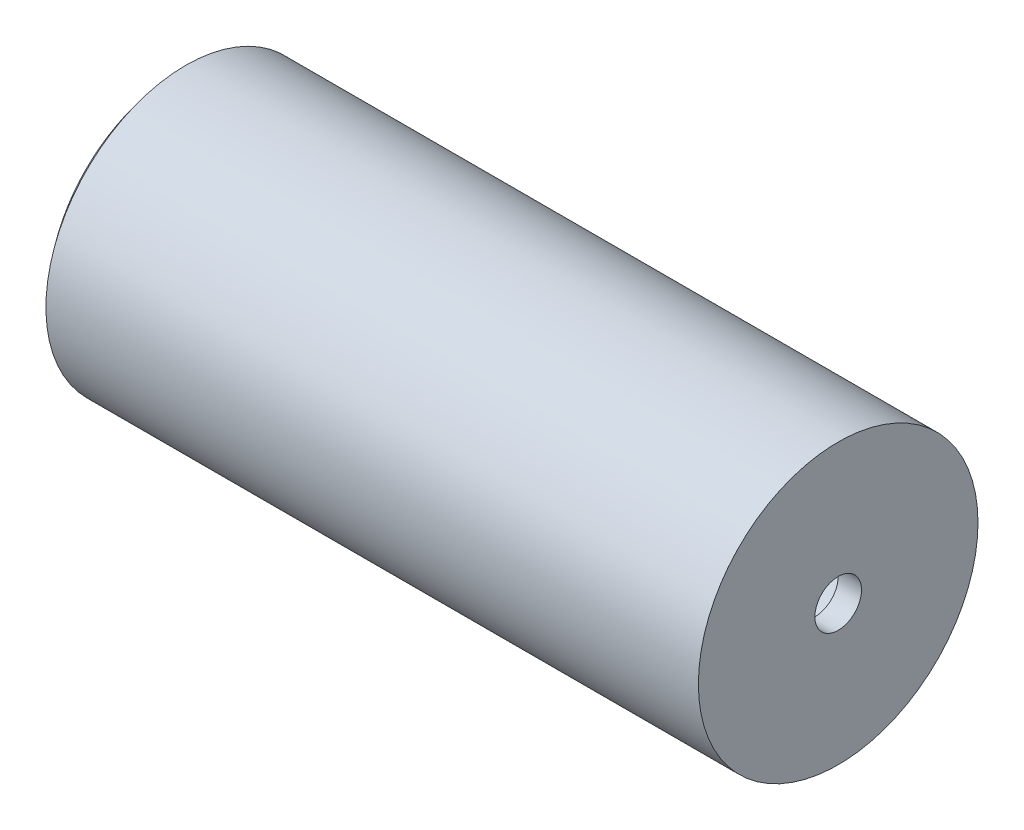
ISO-10303-21;
HEADER;
FILE_DESCRIPTION(('STEP AP214'),'2;1');
FILE_NAME('part.step','',(''),(''),'','','');
FILE_SCHEMA(('AUTOMOTIVE_DESIGN { 1 0 10303 214 1 1 1 1 }'));
ENDSEC;
DATA;
#1=APPLICATION_CONTEXT('core data for automotive mechanical design processes');
#2=APPLICATION_PROTOCOL_DEFINITION('international standard','automotive_design',2000,#1);
#3=PRODUCT_CONTEXT('',#1,'mechanical');
#4=PRODUCT('Part','Part','',(#3));
#5=PRODUCT_RELATED_PRODUCT_CATEGORY('part','',(#4));
#6=PRODUCT_DEFINITION_FORMATION('','',#4);
#7=PRODUCT_DEFINITION_CONTEXT('part definition',#1,'design');
#8=PRODUCT_DEFINITION('design','',#6,#7);
#9=PRODUCT_DEFINITION_SHAPE('','',#8);
#10=(LENGTH_UNIT() NAMED_UNIT(*) SI_UNIT(.MILLI.,.METRE.));
#11=(NAMED_UNIT(*) PLANE_ANGLE_UNIT() SI_UNIT($,.RADIAN.));
#12=(NAMED_UNIT(*) SI_UNIT($,.STERADIAN.) SOLID_ANGLE_UNIT());
#13=UNCERTAINTY_MEASURE_WITH_UNIT(LENGTH_MEASURE(1.E-05),#10,'distance_accuracy_value','');
#14=(GEOMETRIC_REPRESENTATION_CONTEXT(3) GLOBAL_UNCERTAINTY_ASSIGNED_CONTEXT((#13)) GLOBAL_UNIT_ASSIGNED_CONTEXT((#10,
#11,#12)) REPRESENTATION_CONTEXT('',''));
#15=CARTESIAN_POINT('',(0.,0.,0.));
#16=DIRECTION('',(0.,0.,1.));
#17=DIRECTION('',(1.,0.,0.));
#18=AXIS2_PLACEMENT_3D('',#15,#16,#17);
#19=CARTESIAN_POINT('',(0.,0.,0.));
#20=DIRECTION('',(1.,0.,0.));
#21=DIRECTION('',(0.,0.,-1.));
#22=AXIS2_PLACEMENT_3D('',#19,#20,#21);
#23=CYLINDRICAL_SURFACE('',#22,5.00000000000004);
#24=CARTESIAN_POINT('',(169.943031877068,0.,0.));
#25=DIRECTION('',(1.,0.,0.));
#26=DIRECTION('',(0.,0.,-1.));
#27=AXIS2_PLACEMENT_3D('',#24,#25,#26);
#28=CIRCLE('',#27,5.00000000000004);
#29=CARTESIAN_POINT('',(169.943031877068,0.,-5.00000000000004));
#30=VERTEX_POINT('',#29);
#31=EDGE_CURVE('E10',#30,#30,#28,.T.);
#32=ORIENTED_EDGE('',*,*,#31,.T.);
#33=EDGE_LOOP('',(#32));
#34=FACE_BOUND('',#33,.T.);
#35=CARTESIAN_POINT('',(164.943031877068,0.,0.));
#36=DIRECTION('',(1.,0.,0.));
#37=DIRECTION('',(0.,0.,-1.));
#38=AXIS2_PLACEMENT_3D('',#35,#36,#37);
#39=CIRCLE('',#38,5.00000000000004);
#40=CARTESIAN_POINT('',(164.943031877068,0.,-5.00000000000004));
#41=VERTEX_POINT('',#40);
#42=EDGE_CURVE('E57',#41,#41,#39,.T.);
#43=ORIENTED_EDGE('',*,*,#42,.F.);
#44=EDGE_LOOP('',(#43));
#45=FACE_BOUND('',#44,.T.);
#46=ADVANCED_FACE('F35',(#34,#45),#23,.F.);
#47=CARTESIAN_POINT('',(169.943031877068,5.00000000000004,0.));
#48=DIRECTION('',(1.,0.,0.));
#49=DIRECTION('',(0.,0.,-1.));
#50=AXIS2_PLACEMENT_3D('',#47,#48,#49);
#51=PLANE('',#50);
#52=CARTESIAN_POINT('',(169.943031877068,0.,0.));
#53=DIRECTION('',(1.,0.,0.));
#54=DIRECTION('',(0.,0.,-1.));
#55=AXIS2_PLACEMENT_3D('',#52,#53,#54);
#56=CIRCLE('',#55,30.);
#57=CARTESIAN_POINT('',(169.943031877068,0.,-30.));
#58=VERTEX_POINT('',#57);
#59=EDGE_CURVE('E41',#58,#58,#56,.T.);
#60=ORIENTED_EDGE('',*,*,#59,.T.);
#61=EDGE_LOOP('',(#60));
#62=FACE_BOUND('',#61,.T.);
#63=ORIENTED_EDGE('',*,*,#31,.F.);
#64=EDGE_LOOP('',(#63));
#65=FACE_BOUND('',#64,.T.);
#66=ADVANCED_FACE('F65',(#62,#65),#51,.T.);
#67=CARTESIAN_POINT('',(0.,0.,0.));
#68=DIRECTION('',(1.,0.,0.));
#69=DIRECTION('',(0.,0.,-1.));
#70=AXIS2_PLACEMENT_3D('',#67,#68,#69);
#71=CYLINDRICAL_SURFACE('',#70,30.);
#72=CARTESIAN_POINT('',(29.9430318770676,0.,0.));
#73=DIRECTION('',(1.,0.,0.));
#74=DIRECTION('',(0.,0.,-1.));
#75=AXIS2_PLACEMENT_3D('',#72,#73,#74);
#76=CIRCLE('',#75,30.);
#77=CARTESIAN_POINT('',(29.9430318770676,0.,-30.));
#78=VERTEX_POINT('',#77);
#79=EDGE_CURVE('E45',#78,#78,#76,.T.);
#80=ORIENTED_EDGE('',*,*,#79,.T.);
#81=EDGE_LOOP('',(#80));
#82=FACE_BOUND('',#81,.T.);
#83=ORIENTED_EDGE('',*,*,#59,.F.);
#84=EDGE_LOOP('',(#83));
#85=FACE_BOUND('',#84,.T.);
#86=ADVANCED_FACE('F69',(#82,#85),#71,.T.);
#87=CARTESIAN_POINT('',(65.7326011914095,0.,0.));
#88=DIRECTION('',(1.,0.,0.));
#89=DIRECTION('',(0.,1.,0.));
#90=AXIS2_PLACEMENT_3D('',#87,#88,#89);
#91=SPHERICAL_SURFACE('',#90,46.7000350289599);
#92=ORIENTED_EDGE('',*,*,#79,.F.);
#93=EDGE_LOOP('',(#92));
#94=FACE_BOUND('',#93,.T.);
#95=ADVANCED_FACE('F73',(#94),#91,.T.);
#96=CARTESIAN_POINT('',(65.7326011914095,0.,0.));
#97=DIRECTION('',(1.,0.,0.));
#98=DIRECTION('',(0.,1.,0.));
#99=AXIS2_PLACEMENT_3D('',#96,#97,#98);
#100=SPHERICAL_SURFACE('',#99,41.7000350289599);
#101=CARTESIAN_POINT('',(32.357566788184,0.,0.));
#102=DIRECTION('',(1.,0.,0.));
#103=DIRECTION('',(0.,0.,-1.));
#104=AXIS2_PLACEMENT_3D('',#101,#102,#103);
#105=CIRCLE('',#104,25.);
#106=CARTESIAN_POINT('',(32.357566788184,0.,-25.));
#107=VERTEX_POINT('',#106);
#108=EDGE_CURVE('E49',#107,#107,#105,.T.);
#109=ORIENTED_EDGE('',*,*,#108,.T.);
#110=EDGE_LOOP('',(#109));
#111=FACE_BOUND('',#110,.T.);
#112=ADVANCED_FACE('F80',(#111),#100,.F.);
#113=CARTESIAN_POINT('',(0.,0.,0.));
#114=DIRECTION('',(1.,0.,0.));
#115=DIRECTION('',(0.,0.,-1.));
#116=AXIS2_PLACEMENT_3D('',#113,#114,#115);
#117=CYLINDRICAL_SURFACE('',#116,25.);
#118=CARTESIAN_POINT('',(164.943031877068,0.,0.));
#119=DIRECTION('',(1.,0.,0.));
#120=DIRECTION('',(0.,0.,-1.));
#121=AXIS2_PLACEMENT_3D('',#118,#119,#120);
#122=CIRCLE('',#121,25.);
#123=CARTESIAN_POINT('',(164.943031877068,0.,-25.));
#124=VERTEX_POINT('',#123);
#125=EDGE_CURVE('E54',#124,#124,#122,.T.);
#126=ORIENTED_EDGE('',*,*,#125,.T.);
#127=EDGE_LOOP('',(#126));
#128=FACE_BOUND('',#127,.T.);
#129=ORIENTED_EDGE('',*,*,#108,.F.);
#130=EDGE_LOOP('',(#129));
#131=FACE_BOUND('',#130,.T.);
#132=ADVANCED_FACE('F84',(#128,#131),#117,.F.);
#133=CARTESIAN_POINT('',(164.943031877068,25.,0.));
#134=DIRECTION('',(-1.,0.,0.));
#135=DIRECTION('',(0.,0.,1.));
#136=AXIS2_PLACEMENT_3D('',#133,#134,#135);
#137=PLANE('',#136);
#138=ORIENTED_EDGE('',*,*,#42,.T.);
#139=EDGE_LOOP('',(#138));
#140=FACE_BOUND('',#139,.T.);
#141=ORIENTED_EDGE('',*,*,#125,.F.);
#142=EDGE_LOOP('',(#141));
#143=FACE_BOUND('',#142,.T.);
#144=ADVANCED_FACE('F61',(#140,#143),#137,.T.);
#145=CLOSED_SHELL('',(#46,#66,#86,#95,#112,#132,#144));
#146=MANIFOLD_SOLID_BREP('B2',#145);
#147=ADVANCED_BREP_SHAPE_REPRESENTATION('',(#18,#146),#14);
#148=SHAPE_DEFINITION_REPRESENTATION(#9,#147);
ENDSEC;
END-ISO-10303-21;
